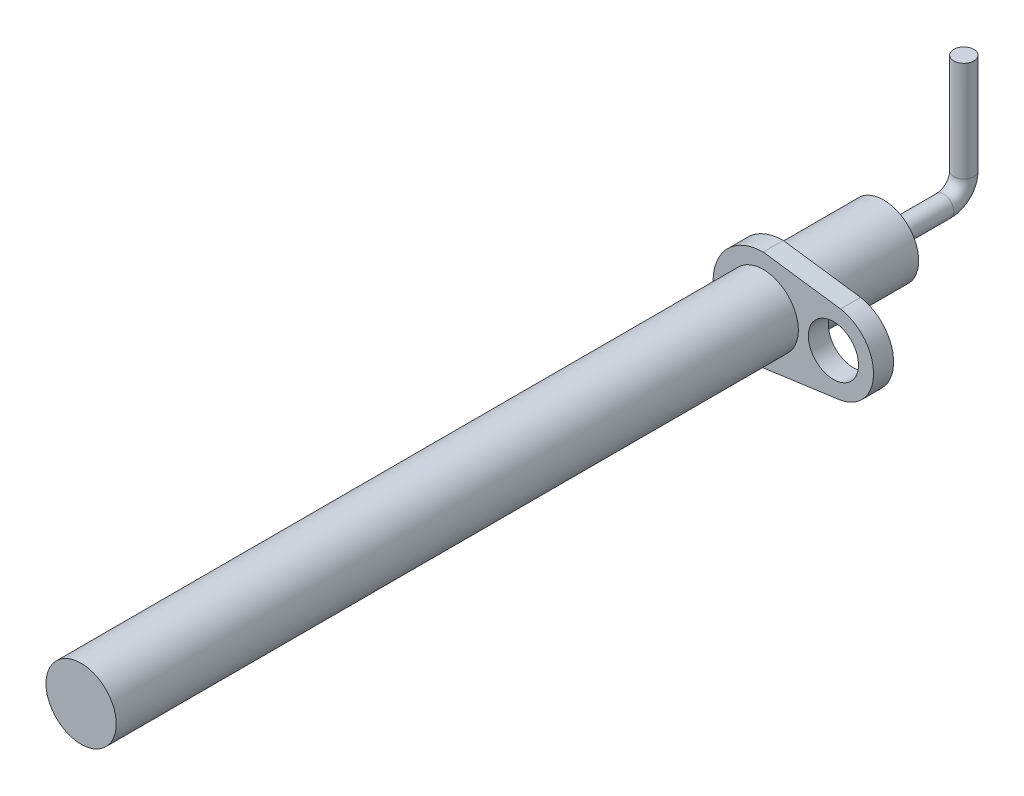
ISO-10303-21;
HEADER;
FILE_DESCRIPTION(('STEP AP214'),'2;1');
FILE_NAME('part.step','',(''),(''),'','','');
FILE_SCHEMA(('AUTOMOTIVE_DESIGN { 1 0 10303 214 1 1 1 1 }'));
ENDSEC;
DATA;
#1=APPLICATION_CONTEXT('core data for automotive mechanical design processes');
#2=APPLICATION_PROTOCOL_DEFINITION('international standard','automotive_design',2000,#1);
#3=PRODUCT_CONTEXT('',#1,'mechanical');
#4=PRODUCT('Part','Part','',(#3));
#5=PRODUCT_RELATED_PRODUCT_CATEGORY('part','',(#4));
#6=PRODUCT_DEFINITION_FORMATION('','',#4);
#7=PRODUCT_DEFINITION_CONTEXT('part definition',#1,'design');
#8=PRODUCT_DEFINITION('design','',#6,#7);
#9=PRODUCT_DEFINITION_SHAPE('','',#8);
#10=(LENGTH_UNIT() NAMED_UNIT(*) SI_UNIT(.MILLI.,.METRE.));
#11=(NAMED_UNIT(*) PLANE_ANGLE_UNIT() SI_UNIT($,.RADIAN.));
#12=(NAMED_UNIT(*) SI_UNIT($,.STERADIAN.) SOLID_ANGLE_UNIT());
#13=UNCERTAINTY_MEASURE_WITH_UNIT(LENGTH_MEASURE(1.E-05),#10,'distance_accuracy_value','');
#14=(GEOMETRIC_REPRESENTATION_CONTEXT(3) GLOBAL_UNCERTAINTY_ASSIGNED_CONTEXT((#13)) GLOBAL_UNIT_ASSIGNED_CONTEXT((#10,
#11,#12)) REPRESENTATION_CONTEXT('',''));
#15=CARTESIAN_POINT('',(0.,0.,0.));
#16=DIRECTION('',(0.,0.,1.));
#17=DIRECTION('',(1.,0.,0.));
#18=AXIS2_PLACEMENT_3D('',#15,#16,#17);
#19=CARTESIAN_POINT('',(0.,0.,40.));
#20=DIRECTION('',(0.,0.,-1.));
#21=DIRECTION('',(-1.,0.,0.));
#22=AXIS2_PLACEMENT_3D('',#19,#20,#21);
#23=CYLINDRICAL_SURFACE('',#22,1.75);
#24=CARTESIAN_POINT('',(0.,0.,5.));
#25=DIRECTION('',(0.,0.,-1.));
#26=DIRECTION('',(-1.,0.,0.));
#27=AXIS2_PLACEMENT_3D('',#24,#25,#26);
#28=CIRCLE('',#27,1.75);
#29=CARTESIAN_POINT('',(-1.75,0.,5.));
#30=VERTEX_POINT('',#29);
#31=EDGE_CURVE('E50',#30,#30,#28,.T.);
#32=ORIENTED_EDGE('',*,*,#31,.T.);
#33=EDGE_LOOP('',(#32));
#34=FACE_BOUND('',#33,.T.);
#35=CARTESIAN_POINT('',(0.,0.,0.));
#36=DIRECTION('',(0.,0.,1.));
#37=DIRECTION('',(1.,0.,0.));
#38=AXIS2_PLACEMENT_3D('',#35,#36,#37);
#39=CIRCLE('',#38,1.75);
#40=CARTESIAN_POINT('',(1.75,0.,0.));
#41=VERTEX_POINT('',#40);
#42=EDGE_CURVE('E139',#41,#41,#39,.T.);
#43=ORIENTED_EDGE('',*,*,#42,.T.);
#44=EDGE_LOOP('',(#43));
#45=FACE_BOUND('',#44,.T.);
#46=ADVANCED_FACE('F47',(#34,#45),#23,.T.);
#47=CARTESIAN_POINT('',(0.,0.,0.));
#48=DIRECTION('',(0.,0.,1.));
#49=DIRECTION('',(1.,0.,0.));
#50=AXIS2_PLACEMENT_3D('',#47,#48,#49);
#51=PLANE('',#50);
#52=CARTESIAN_POINT('',(0.,0.,0.));
#53=DIRECTION('',(0.,0.,1.));
#54=DIRECTION('',(1.,0.,0.));
#55=AXIS2_PLACEMENT_3D('',#52,#53,#54);
#56=CIRCLE('',#55,0.5);
#57=CARTESIAN_POINT('',(0.5,0.,0.));
#58=VERTEX_POINT('',#57);
#59=EDGE_CURVE('E297',#58,#58,#56,.T.);
#60=ORIENTED_EDGE('',*,*,#59,.T.);
#61=EDGE_LOOP('',(#60));
#62=FACE_BOUND('',#61,.T.);
#63=ORIENTED_EDGE('',*,*,#42,.F.);
#64=EDGE_LOOP('',(#63));
#65=FACE_BOUND('',#64,.T.);
#66=ADVANCED_FACE('F161',(#62,#65),#51,.F.);
#67=CARTESIAN_POINT('',(0.338323179704949,2.4533442674789,5.));
#68=DIRECTION('',(0.136610003324938,0.990624907314348,0.));
#69=DIRECTION('',(-0.990624907314348,0.136610003324938,0.));
#70=AXIS2_PLACEMENT_3D('',#67,#68,#69);
#71=PLANE('',#70);
#72=DIRECTION('',(-0.990624907314348,0.136610003324938,0.));
#73=VECTOR('',#72,1.);
#74=CARTESIAN_POINT('',(0.338323179704949,2.4533442674789,6.));
#75=LINE('',#74,#73);
#76=CARTESIAN_POINT('',(3.85156177106147,1.96885863411473,6.));
#77=VERTEX_POINT('',#76);
#78=CARTESIAN_POINT('',(0.,2.5,6.));
#79=VERTEX_POINT('',#78);
#80=EDGE_CURVE('E103',#77,#79,#75,.T.);
#81=ORIENTED_EDGE('',*,*,#80,.F.);
#82=DIRECTION('',(0.,0.,1.));
#83=VECTOR('',#82,1.);
#84=CARTESIAN_POINT('',(3.85156177106147,1.96885863411473,5.));
#85=LINE('',#84,#83);
#86=CARTESIAN_POINT('',(3.85156177106147,1.96885863411473,5.));
#87=VERTEX_POINT('',#86);
#88=EDGE_CURVE('E88',#87,#77,#85,.T.);
#89=ORIENTED_EDGE('',*,*,#88,.F.);
#90=DIRECTION('',(-0.990624907314348,0.136610003324938,0.));
#91=VECTOR('',#90,1.);
#92=CARTESIAN_POINT('',(0.338323179704949,2.4533442674789,5.));
#93=LINE('',#92,#91);
#94=CARTESIAN_POINT('',(0.,2.5,5.));
#95=VERTEX_POINT('',#94);
#96=EDGE_CURVE('E113',#87,#95,#93,.T.);
#97=ORIENTED_EDGE('',*,*,#96,.T.);
#98=DIRECTION('',(0.,0.,1.));
#99=VECTOR('',#98,1.);
#100=CARTESIAN_POINT('',(0.,2.5,5.));
#101=LINE('',#100,#99);
#102=EDGE_CURVE('E64',#95,#79,#101,.T.);
#103=ORIENTED_EDGE('',*,*,#102,.T.);
#104=EDGE_LOOP('',(#81,#89,#97,#103));
#105=FACE_BOUND('',#104,.T.);
#106=ADVANCED_FACE('F158',(#105),#71,.T.);
#107=CARTESIAN_POINT('',(3.5,0.,5.));
#108=DIRECTION('',(0.,0.,1.));
#109=DIRECTION('',(1.,0.,0.));
#110=AXIS2_PLACEMENT_3D('',#107,#108,#109);
#111=CYLINDRICAL_SURFACE('',#110,2.);
#112=CARTESIAN_POINT('',(3.5,0.,6.));
#113=DIRECTION('',(0.,0.,-1.));
#114=DIRECTION('',(-1.,0.,0.));
#115=AXIS2_PLACEMENT_3D('',#112,#113,#114);
#116=CIRCLE('',#115,2.);
#117=CARTESIAN_POINT('',(3.85156177106147,-1.96885863411473,6.));
#118=VERTEX_POINT('',#117);
#119=EDGE_CURVE('E124',#77,#118,#116,.T.);
#120=ORIENTED_EDGE('',*,*,#119,.T.);
#121=DIRECTION('',(0.,0.,1.));
#122=VECTOR('',#121,1.);
#123=CARTESIAN_POINT('',(3.85156177106147,-1.96885863411473,5.));
#124=LINE('',#123,#122);
#125=CARTESIAN_POINT('',(3.85156177106147,-1.96885863411473,5.));
#126=VERTEX_POINT('',#125);
#127=EDGE_CURVE('E133',#126,#118,#124,.T.);
#128=ORIENTED_EDGE('',*,*,#127,.F.);
#129=CARTESIAN_POINT('',(3.5,0.,5.));
#130=DIRECTION('',(0.,0.,-1.));
#131=DIRECTION('',(-1.,0.,0.));
#132=AXIS2_PLACEMENT_3D('',#129,#130,#131);
#133=CIRCLE('',#132,2.);
#134=EDGE_CURVE('E116',#87,#126,#133,.T.);
#135=ORIENTED_EDGE('',*,*,#134,.F.);
#136=ORIENTED_EDGE('',*,*,#88,.T.);
#137=EDGE_LOOP('',(#120,#128,#135,#136));
#138=FACE_BOUND('',#137,.T.);
#139=ADVANCED_FACE('F160',(#138),#111,.T.);
#140=CARTESIAN_POINT('',(0.338323179704949,-2.4533442674789,5.));
#141=DIRECTION('',(-0.136610003324938,0.990624907314348,0.));
#142=DIRECTION('',(-0.990624907314348,-0.136610003324938,0.));
#143=AXIS2_PLACEMENT_3D('',#140,#141,#142);
#144=PLANE('',#143);
#145=DIRECTION('',(-0.990624907314348,-0.136610003324938,0.));
#146=VECTOR('',#145,1.);
#147=CARTESIAN_POINT('',(0.338323179704949,-2.4533442674789,6.));
#148=LINE('',#147,#146);
#149=CARTESIAN_POINT('',(0.,-2.5,6.));
#150=VERTEX_POINT('',#149);
#151=EDGE_CURVE('E127',#118,#150,#148,.T.);
#152=ORIENTED_EDGE('',*,*,#151,.T.);
#153=DIRECTION('',(0.,0.,1.));
#154=VECTOR('',#153,1.);
#155=CARTESIAN_POINT('',(0.,-2.5,5.));
#156=LINE('',#155,#154);
#157=CARTESIAN_POINT('',(0.,-2.5,5.));
#158=VERTEX_POINT('',#157);
#159=EDGE_CURVE('E80',#158,#150,#156,.T.);
#160=ORIENTED_EDGE('',*,*,#159,.F.);
#161=DIRECTION('',(-0.990624907314348,-0.136610003324938,0.));
#162=VECTOR('',#161,1.);
#163=CARTESIAN_POINT('',(0.338323179704949,-2.4533442674789,5.));
#164=LINE('',#163,#162);
#165=EDGE_CURVE('E119',#126,#158,#164,.T.);
#166=ORIENTED_EDGE('',*,*,#165,.F.);
#167=ORIENTED_EDGE('',*,*,#127,.T.);
#168=EDGE_LOOP('',(#152,#160,#166,#167));
#169=FACE_BOUND('',#168,.T.);
#170=ADVANCED_FACE('F167',(#169),#144,.F.);
#171=CARTESIAN_POINT('',(3.5,0.,5.));
#172=DIRECTION('',(0.,0.,1.));
#173=DIRECTION('',(1.,0.,0.));
#174=AXIS2_PLACEMENT_3D('',#171,#172,#173);
#175=CYLINDRICAL_SURFACE('',#174,1.25);
#176=CARTESIAN_POINT('',(3.5,0.,5.));
#177=DIRECTION('',(0.,0.,-1.));
#178=DIRECTION('',(-1.,0.,0.));
#179=AXIS2_PLACEMENT_3D('',#176,#177,#178);
#180=CIRCLE('',#179,1.25);
#181=CARTESIAN_POINT('',(2.25,0.,5.));
#182=VERTEX_POINT('',#181);
#183=EDGE_CURVE('E110',#182,#182,#180,.T.);
#184=ORIENTED_EDGE('',*,*,#183,.T.);
#185=EDGE_LOOP('',(#184));
#186=FACE_BOUND('',#185,.T.);
#187=CARTESIAN_POINT('',(3.5,0.,6.));
#188=DIRECTION('',(0.,0.,-1.));
#189=DIRECTION('',(-1.,0.,0.));
#190=AXIS2_PLACEMENT_3D('',#187,#188,#189);
#191=CIRCLE('',#190,1.25);
#192=CARTESIAN_POINT('',(2.25,0.,6.));
#193=VERTEX_POINT('',#192);
#194=EDGE_CURVE('E99',#193,#193,#191,.T.);
#195=ORIENTED_EDGE('',*,*,#194,.F.);
#196=EDGE_LOOP('',(#195));
#197=FACE_BOUND('',#196,.T.);
#198=ADVANCED_FACE('F205',(#186,#197),#175,.F.);
#199=CARTESIAN_POINT('',(0.,0.,5.));
#200=DIRECTION('',(0.,0.,1.));
#201=DIRECTION('',(1.,0.,0.));
#202=AXIS2_PLACEMENT_3D('',#199,#200,#201);
#203=CYLINDRICAL_SURFACE('',#202,2.5);
#204=CARTESIAN_POINT('',(0.,0.,6.));
#205=DIRECTION('',(0.,0.,-1.));
#206=DIRECTION('',(-1.,0.,0.));
#207=AXIS2_PLACEMENT_3D('',#204,#205,#206);
#208=CIRCLE('',#207,2.5);
#209=EDGE_CURVE('E114',#79,#150,#208,.F.);
#210=ORIENTED_EDGE('',*,*,#209,.F.);
#211=ORIENTED_EDGE('',*,*,#102,.F.);
#212=CARTESIAN_POINT('',(0.,0.,5.));
#213=DIRECTION('',(0.,0.,-1.));
#214=DIRECTION('',(-1.,0.,0.));
#215=AXIS2_PLACEMENT_3D('',#212,#213,#214);
#216=CIRCLE('',#215,2.5);
#217=EDGE_CURVE('E121',#95,#158,#216,.F.);
#218=ORIENTED_EDGE('',*,*,#217,.T.);
#219=ORIENTED_EDGE('',*,*,#159,.T.);
#220=EDGE_LOOP('',(#210,#211,#218,#219));
#221=FACE_BOUND('',#220,.T.);
#222=ADVANCED_FACE('F151',(#221),#203,.T.);
#223=CARTESIAN_POINT('',(0.,0.,5.));
#224=DIRECTION('',(0.,0.,-1.));
#225=DIRECTION('',(-1.,0.,0.));
#226=AXIS2_PLACEMENT_3D('',#223,#224,#225);
#227=PLANE('',#226);
#228=ORIENTED_EDGE('',*,*,#31,.F.);
#229=EDGE_LOOP('',(#228));
#230=FACE_BOUND('',#229,.T.);
#231=ORIENTED_EDGE('',*,*,#183,.F.);
#232=EDGE_LOOP('',(#231));
#233=FACE_BOUND('',#232,.T.);
#234=ORIENTED_EDGE('',*,*,#96,.F.);
#235=ORIENTED_EDGE('',*,*,#134,.T.);
#236=ORIENTED_EDGE('',*,*,#165,.T.);
#237=ORIENTED_EDGE('',*,*,#217,.F.);
#238=EDGE_LOOP('',(#234,#235,#236,#237));
#239=FACE_BOUND('',#238,.T.);
#240=ADVANCED_FACE('F147',(#230,#233,#239),#227,.T.);
#241=CARTESIAN_POINT('',(0.,0.,6.));
#242=DIRECTION('',(0.,0.,-1.));
#243=DIRECTION('',(-1.,0.,0.));
#244=AXIS2_PLACEMENT_3D('',#241,#242,#243);
#245=PLANE('',#244);
#246=CARTESIAN_POINT('',(0.,0.,6.));
#247=DIRECTION('',(0.,0.,-1.));
#248=DIRECTION('',(-1.,0.,0.));
#249=AXIS2_PLACEMENT_3D('',#246,#247,#248);
#250=CIRCLE('',#249,1.75);
#251=CARTESIAN_POINT('',(-1.75,0.,6.));
#252=VERTEX_POINT('',#251);
#253=EDGE_CURVE('E12',#252,#252,#250,.T.);
#254=ORIENTED_EDGE('',*,*,#253,.T.);
#255=EDGE_LOOP('',(#254));
#256=FACE_BOUND('',#255,.T.);
#257=ORIENTED_EDGE('',*,*,#194,.T.);
#258=EDGE_LOOP('',(#257));
#259=FACE_BOUND('',#258,.T.);
#260=ORIENTED_EDGE('',*,*,#80,.T.);
#261=ORIENTED_EDGE('',*,*,#209,.T.);
#262=ORIENTED_EDGE('',*,*,#151,.F.);
#263=ORIENTED_EDGE('',*,*,#119,.F.);
#264=EDGE_LOOP('',(#260,#261,#262,#263));
#265=FACE_BOUND('',#264,.T.);
#266=ADVANCED_FACE('F150',(#256,#259,#265),#245,.F.);
#267=CARTESIAN_POINT('',(0.,0.,40.));
#268=DIRECTION('',(0.,0.,1.));
#269=DIRECTION('',(1.,0.,0.));
#270=AXIS2_PLACEMENT_3D('',#267,#268,#269);
#271=PLANE('',#270);
#272=CARTESIAN_POINT('',(0.,0.,40.));
#273=DIRECTION('',(0.,0.,1.));
#274=DIRECTION('',(1.,0.,0.));
#275=AXIS2_PLACEMENT_3D('',#272,#273,#274);
#276=CIRCLE('',#275,1.75);
#277=CARTESIAN_POINT('',(1.75,0.,40.));
#278=VERTEX_POINT('',#277);
#279=EDGE_CURVE('E56',#278,#278,#276,.T.);
#280=ORIENTED_EDGE('',*,*,#279,.T.);
#281=EDGE_LOOP('',(#280));
#282=FACE_BOUND('',#281,.T.);
#283=ADVANCED_FACE('F178',(#282),#271,.T.);
#284=ORIENTED_EDGE('',*,*,#279,.F.);
#285=EDGE_LOOP('',(#284));
#286=FACE_BOUND('',#285,.T.);
#287=ORIENTED_EDGE('',*,*,#253,.F.);
#288=EDGE_LOOP('',(#287));
#289=FACE_BOUND('',#288,.T.);
#290=ADVANCED_FACE('F173',(#286,#289),#23,.T.);
#291=CARTESIAN_POINT('',(0.,6.,-4.));
#292=DIRECTION('',(0.,-1.,0.));
#293=DIRECTION('',(1.,0.,0.));
#294=AXIS2_PLACEMENT_3D('',#291,#292,#293);
#295=PLANE('',#294);
#296=CARTESIAN_POINT('',(0.,6.,-4.));
#297=DIRECTION('',(0.,-1.,0.));
#298=DIRECTION('',(1.,0.,0.));
#299=AXIS2_PLACEMENT_3D('',#296,#297,#298);
#300=CIRCLE('',#299,0.5);
#301=CARTESIAN_POINT('',(0.5,6.,-4.));
#302=VERTEX_POINT('',#301);
#303=EDGE_CURVE('E95',#302,#302,#300,.T.);
#304=ORIENTED_EDGE('',*,*,#303,.F.);
#305=EDGE_LOOP('',(#304));
#306=FACE_BOUND('',#305,.T.);
#307=ADVANCED_FACE('F177',(#306),#295,.F.);
#308=CARTESIAN_POINT('',(0.,0.,0.));
#309=DIRECTION('',(0.,0.,-1.));
#310=DIRECTION('',(-1.,0.,0.));
#311=AXIS2_PLACEMENT_3D('',#308,#309,#310);
#312=CYLINDRICAL_SURFACE('',#311,0.5);
#313=CARTESIAN_POINT('',(0.,0.,-3.));
#314=DIRECTION('',(0.,0.,1.));
#315=DIRECTION('',(1.,0.,0.));
#316=AXIS2_PLACEMENT_3D('',#313,#314,#315);
#317=CIRCLE('',#316,0.5);
#318=CARTESIAN_POINT('',(0.,-0.5,-3.));
#319=VERTEX_POINT('',#318);
#320=EDGE_CURVE('E106',#319,#319,#317,.T.);
#321=ORIENTED_EDGE('',*,*,#320,.T.);
#322=EDGE_LOOP('',(#321));
#323=FACE_BOUND('',#322,.T.);
#324=ORIENTED_EDGE('',*,*,#59,.F.);
#325=EDGE_LOOP('',(#324));
#326=FACE_BOUND('',#325,.T.);
#327=ADVANCED_FACE('F184',(#323,#326),#312,.T.);
#328=CARTESIAN_POINT('',(0.,1.,-3.));
#329=DIRECTION('',(1.,0.,0.));
#330=DIRECTION('',(0.,1.,0.));
#331=AXIS2_PLACEMENT_3D('',#328,#329,#330);
#332=TOROIDAL_SURFACE('',#331,1.,0.5);
#333=CARTESIAN_POINT('',(0.,1.,-4.));
#334=DIRECTION('',(0.,-1.,0.));
#335=DIRECTION('',(1.,0.,0.));
#336=AXIS2_PLACEMENT_3D('',#333,#334,#335);
#337=CIRCLE('',#336,0.5);
#338=CARTESIAN_POINT('',(0.,1.,-4.5));
#339=VERTEX_POINT('',#338);
#340=EDGE_CURVE('E100',#339,#339,#337,.T.);
#341=CARTESIAN_POINT('',(0.,1.,-3.));
#342=DIRECTION('',(1.,0.,0.));
#343=DIRECTION('',(0.,1.,0.));
#344=AXIS2_PLACEMENT_3D('',#341,#342,#343);
#345=CIRCLE('',#344,1.5);
#346=EDGE_CURVE('',#319,#339,#345,.T.);
#347=ORIENTED_EDGE('',*,*,#320,.F.);
#348=ORIENTED_EDGE('',*,*,#340,.T.);
#349=ORIENTED_EDGE('',*,*,#346,.T.);
#350=ORIENTED_EDGE('',*,*,#346,.F.);
#351=EDGE_LOOP('',(#347,#349,#348,#350));
#352=FACE_BOUND('',#351,.T.);
#353=ADVANCED_FACE('F191',(#352),#332,.T.);
#354=CARTESIAN_POINT('',(0.,1.,-4.));
#355=DIRECTION('',(0.,1.,0.));
#356=DIRECTION('',(-1.,0.,0.));
#357=AXIS2_PLACEMENT_3D('',#354,#355,#356);
#358=CYLINDRICAL_SURFACE('',#357,0.5);
#359=ORIENTED_EDGE('',*,*,#303,.T.);
#360=EDGE_LOOP('',(#359));
#361=FACE_BOUND('',#360,.T.);
#362=ORIENTED_EDGE('',*,*,#340,.F.);
#363=EDGE_LOOP('',(#362));
#364=FACE_BOUND('',#363,.T.);
#365=ADVANCED_FACE('F96',(#361,#364),#358,.T.);
#366=CLOSED_SHELL('',(#46,#66,#106,#139,#170,#198,#222,#240,#266,#283,#290,#307,#327,#353,#365));
#367=MANIFOLD_SOLID_BREP('B2',#366);
#368=ADVANCED_BREP_SHAPE_REPRESENTATION('',(#18,#367),#14);
#369=SHAPE_DEFINITION_REPRESENTATION(#9,#368);
ENDSEC;
END-ISO-10303-21;
